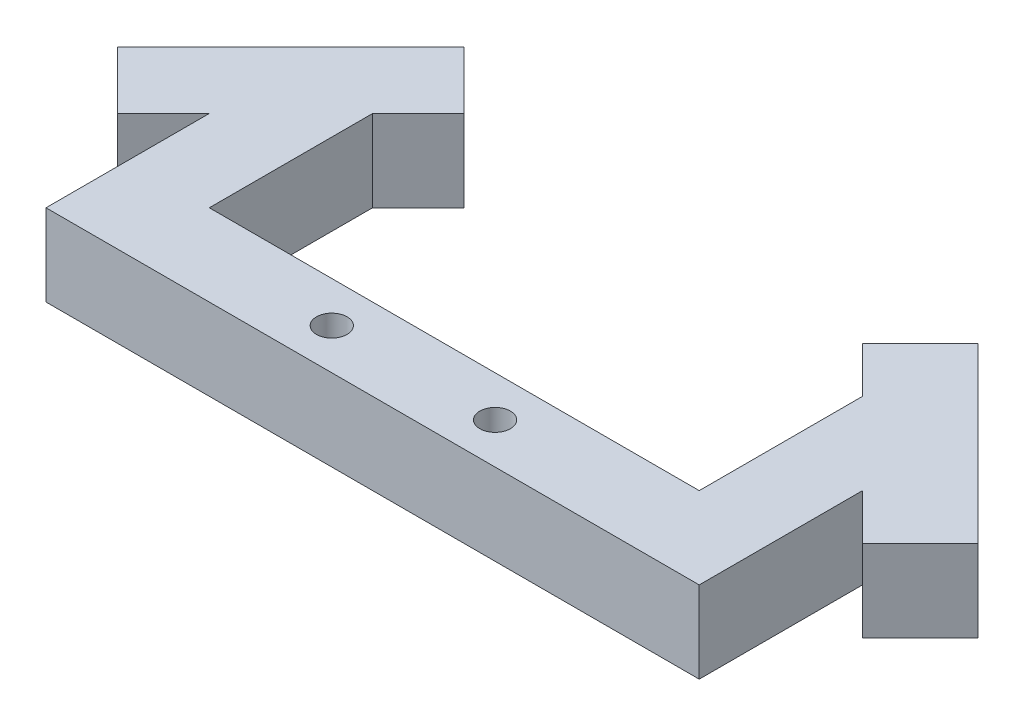
ISO-10303-21;
HEADER;
FILE_DESCRIPTION(('STEP AP214'),'2;1');
FILE_NAME('part.step','',(''),(''),'','','');
FILE_SCHEMA(('AUTOMOTIVE_DESIGN { 1 0 10303 214 1 1 1 1 }'));
ENDSEC;
DATA;
#1=APPLICATION_CONTEXT('core data for automotive mechanical design processes');
#2=APPLICATION_PROTOCOL_DEFINITION('international standard','automotive_design',2000,#1);
#3=PRODUCT_CONTEXT('',#1,'mechanical');
#4=PRODUCT('Part','Part','',(#3));
#5=PRODUCT_RELATED_PRODUCT_CATEGORY('part','',(#4));
#6=PRODUCT_DEFINITION_FORMATION('','',#4);
#7=PRODUCT_DEFINITION_CONTEXT('part definition',#1,'design');
#8=PRODUCT_DEFINITION('design','',#6,#7);
#9=PRODUCT_DEFINITION_SHAPE('','',#8);
#10=(LENGTH_UNIT() NAMED_UNIT(*) SI_UNIT(.MILLI.,.METRE.));
#11=(NAMED_UNIT(*) PLANE_ANGLE_UNIT() SI_UNIT($,.RADIAN.));
#12=(NAMED_UNIT(*) SI_UNIT($,.STERADIAN.) SOLID_ANGLE_UNIT());
#13=UNCERTAINTY_MEASURE_WITH_UNIT(LENGTH_MEASURE(1.E-05),#10,'distance_accuracy_value','');
#14=(GEOMETRIC_REPRESENTATION_CONTEXT(3) GLOBAL_UNCERTAINTY_ASSIGNED_CONTEXT((#13)) GLOBAL_UNIT_ASSIGNED_CONTEXT((#10,
#11,#12)) REPRESENTATION_CONTEXT('',''));
#15=CARTESIAN_POINT('',(0.,0.,0.));
#16=DIRECTION('',(0.,0.,1.));
#17=DIRECTION('',(1.,0.,0.));
#18=AXIS2_PLACEMENT_3D('',#15,#16,#17);
#19=CARTESIAN_POINT('',(0.,25.4,0.));
#20=DIRECTION('',(0.,0.,1.));
#21=DIRECTION('',(1.,0.,0.));
#22=AXIS2_PLACEMENT_3D('',#19,#20,#21);
#23=PLANE('',#22);
#24=DIRECTION('',(-1.,0.,0.));
#25=VECTOR('',#24,1.);
#26=CARTESIAN_POINT('',(0.,0.,0.));
#27=LINE('',#26,#25);
#28=CARTESIAN_POINT('',(101.6,0.,0.));
#29=VERTEX_POINT('',#28);
#30=CARTESIAN_POINT('',(-101.6,0.,0.));
#31=VERTEX_POINT('',#30);
#32=EDGE_CURVE('E185',#29,#31,#27,.T.);
#33=ORIENTED_EDGE('',*,*,#32,.F.);
#34=DIRECTION('',(0.,-1.,0.));
#35=VECTOR('',#34,1.);
#36=CARTESIAN_POINT('',(101.6,25.4,0.));
#37=LINE('',#36,#35);
#38=CARTESIAN_POINT('',(101.6,25.4,0.));
#39=VERTEX_POINT('',#38);
#40=EDGE_CURVE('E11',#39,#29,#37,.T.);
#41=ORIENTED_EDGE('',*,*,#40,.F.);
#42=DIRECTION('',(-1.,0.,0.));
#43=VECTOR('',#42,1.);
#44=CARTESIAN_POINT('',(0.,25.4,0.));
#45=LINE('',#44,#43);
#46=CARTESIAN_POINT('',(-101.6,25.4,0.));
#47=VERTEX_POINT('',#46);
#48=EDGE_CURVE('E225',#39,#47,#45,.T.);
#49=ORIENTED_EDGE('',*,*,#48,.T.);
#50=DIRECTION('',(0.,-1.,0.));
#51=VECTOR('',#50,1.);
#52=CARTESIAN_POINT('',(-101.6,25.4,0.));
#53=LINE('',#52,#51);
#54=EDGE_CURVE('E57',#47,#31,#53,.T.);
#55=ORIENTED_EDGE('',*,*,#54,.T.);
#56=EDGE_LOOP('',(#33,#41,#49,#55));
#57=FACE_BOUND('',#56,.T.);
#58=ADVANCED_FACE('F41',(#57),#23,.T.);
#59=CARTESIAN_POINT('',(101.6,25.4,0.));
#60=DIRECTION('',(-1.,0.,0.));
#61=DIRECTION('',(0.,0.,1.));
#62=AXIS2_PLACEMENT_3D('',#59,#60,#61);
#63=PLANE('',#62);
#64=DIRECTION('',(0.,0.,-1.));
#65=VECTOR('',#64,1.);
#66=CARTESIAN_POINT('',(101.6,0.,0.));
#67=LINE('',#66,#65);
#68=CARTESIAN_POINT('',(101.6,0.,-50.8000000000001));
#69=VERTEX_POINT('',#68);
#70=EDGE_CURVE('E187',#29,#69,#67,.T.);
#71=ORIENTED_EDGE('',*,*,#70,.T.);
#72=DIRECTION('',(0.,-1.,0.));
#73=VECTOR('',#72,1.);
#74=CARTESIAN_POINT('',(101.6,25.4,-50.8000000000001));
#75=LINE('',#74,#73);
#76=CARTESIAN_POINT('',(101.6,25.4,-50.8000000000001));
#77=VERTEX_POINT('',#76);
#78=EDGE_CURVE('E49',#77,#69,#75,.T.);
#79=ORIENTED_EDGE('',*,*,#78,.F.);
#80=DIRECTION('',(0.,0.,-1.));
#81=VECTOR('',#80,1.);
#82=CARTESIAN_POINT('',(101.6,25.4,0.));
#83=LINE('',#82,#81);
#84=EDGE_CURVE('E595',#39,#77,#83,.T.);
#85=ORIENTED_EDGE('',*,*,#84,.F.);
#86=ORIENTED_EDGE('',*,*,#40,.T.);
#87=EDGE_LOOP('',(#71,#79,#85,#86));
#88=FACE_BOUND('',#87,.T.);
#89=ADVANCED_FACE('F259',(#88),#63,.F.);
#90=CARTESIAN_POINT('',(76.1999999999998,25.4,-76.2000000000002));
#91=DIRECTION('',(-0.707106781186546,0.,0.707106781186549));
#92=DIRECTION('',(0.707106781186549,0.,0.707106781186546));
#93=AXIS2_PLACEMENT_3D('',#90,#91,#92);
#94=PLANE('',#93);
#95=DIRECTION('',(-0.707106781186549,0.,-0.707106781186546));
#96=VECTOR('',#95,1.);
#97=CARTESIAN_POINT('',(76.1999999999998,0.,-76.2000000000002));
#98=LINE('',#97,#96);
#99=CARTESIAN_POINT('',(115.840768363208,0.,-36.5592316367926));
#100=VERTEX_POINT('',#99);
#101=EDGE_CURVE('E191',#100,#69,#98,.T.);
#102=ORIENTED_EDGE('',*,*,#101,.F.);
#103=DIRECTION('',(0.,-1.,0.));
#104=VECTOR('',#103,1.);
#105=CARTESIAN_POINT('',(115.840768363208,25.4,-36.5592316367926));
#106=LINE('',#105,#104);
#107=CARTESIAN_POINT('',(115.840768363208,25.4,-36.5592316367926));
#108=VERTEX_POINT('',#107);
#109=EDGE_CURVE('E249',#108,#100,#106,.T.);
#110=ORIENTED_EDGE('',*,*,#109,.F.);
#111=DIRECTION('',(-0.707106781186549,0.,-0.707106781186546));
#112=VECTOR('',#111,1.);
#113=CARTESIAN_POINT('',(76.1999999999998,25.4,-76.2000000000002));
#114=LINE('',#113,#112);
#115=EDGE_CURVE('E256',#108,#77,#114,.T.);
#116=ORIENTED_EDGE('',*,*,#115,.T.);
#117=ORIENTED_EDGE('',*,*,#78,.T.);
#118=EDGE_LOOP('',(#102,#110,#116,#117));
#119=FACE_BOUND('',#118,.T.);
#120=ADVANCED_FACE('F254',(#119),#94,.T.);
#121=CARTESIAN_POINT('',(39.6407683632075,25.4,39.6407683632075));
#122=DIRECTION('',(-0.707106781186548,0.,-0.707106781186547));
#123=DIRECTION('',(-0.707106781186547,0.,0.707106781186548));
#124=AXIS2_PLACEMENT_3D('',#121,#122,#123);
#125=PLANE('',#124);
#126=DIRECTION('',(0.707106781186547,0.,-0.707106781186548));
#127=VECTOR('',#126,1.);
#128=CARTESIAN_POINT('',(39.6407683632075,0.,39.6407683632075));
#129=LINE('',#128,#127);
#130=CARTESIAN_POINT('',(133.801280605346,0.,-54.5197438789309));
#131=VERTEX_POINT('',#130);
#132=EDGE_CURVE('E194',#100,#131,#129,.T.);
#133=ORIENTED_EDGE('',*,*,#132,.T.);
#134=DIRECTION('',(0.,-1.,0.));
#135=VECTOR('',#134,1.);
#136=CARTESIAN_POINT('',(133.801280605346,25.4,-54.5197438789309));
#137=LINE('',#136,#135);
#138=CARTESIAN_POINT('',(133.801280605346,25.4,-54.5197438789309));
#139=VERTEX_POINT('',#138);
#140=EDGE_CURVE('E246',#139,#131,#137,.T.);
#141=ORIENTED_EDGE('',*,*,#140,.F.);
#142=DIRECTION('',(0.707106781186547,0.,-0.707106781186548));
#143=VECTOR('',#142,1.);
#144=CARTESIAN_POINT('',(39.6407683632075,25.4,39.6407683632075));
#145=LINE('',#144,#143);
#146=EDGE_CURVE('E276',#108,#139,#145,.T.);
#147=ORIENTED_EDGE('',*,*,#146,.F.);
#148=ORIENTED_EDGE('',*,*,#109,.T.);
#149=EDGE_LOOP('',(#133,#141,#147,#148));
#150=FACE_BOUND('',#149,.T.);
#151=ADVANCED_FACE('F266',(#150),#125,.F.);
#152=CARTESIAN_POINT('',(94.1605122421383,25.4,-94.1605122421384));
#153=DIRECTION('',(-0.707106781186547,0.,0.707106781186548));
#154=DIRECTION('',(0.707106781186548,0.,0.707106781186547));
#155=AXIS2_PLACEMENT_3D('',#152,#153,#154);
#156=PLANE('',#155);
#157=DIRECTION('',(-0.707106781186548,0.,-0.707106781186547));
#158=VECTOR('',#157,1.);
#159=CARTESIAN_POINT('',(94.1605122421383,0.,-94.1605122421384));
#160=LINE('',#159,#158);
#161=CARTESIAN_POINT('',(79.9197438789308,0.,-108.401280605346));
#162=VERTEX_POINT('',#161);
#163=EDGE_CURVE('E197',#131,#162,#160,.T.);
#164=ORIENTED_EDGE('',*,*,#163,.T.);
#165=DIRECTION('',(0.,-1.,0.));
#166=VECTOR('',#165,1.);
#167=CARTESIAN_POINT('',(79.9197438789308,25.4,-108.401280605346));
#168=LINE('',#167,#166);
#169=CARTESIAN_POINT('',(79.9197438789308,25.4,-108.401280605346));
#170=VERTEX_POINT('',#169);
#171=EDGE_CURVE('E244',#170,#162,#168,.T.);
#172=ORIENTED_EDGE('',*,*,#171,.F.);
#173=DIRECTION('',(-0.707106781186548,0.,-0.707106781186547));
#174=VECTOR('',#173,1.);
#175=CARTESIAN_POINT('',(94.1605122421383,25.4,-94.1605122421384));
#176=LINE('',#175,#174);
#177=EDGE_CURVE('E272',#139,#170,#176,.T.);
#178=ORIENTED_EDGE('',*,*,#177,.F.);
#179=ORIENTED_EDGE('',*,*,#140,.T.);
#180=EDGE_LOOP('',(#164,#172,#178,#179));
#181=FACE_BOUND('',#180,.T.);
#182=ADVANCED_FACE('F270',(#181),#156,.F.);
#183=CARTESIAN_POINT('',(-14.2407683632075,25.4,-14.2407683632075));
#184=DIRECTION('',(-0.707106781186548,0.,-0.707106781186548));
#185=DIRECTION('',(-0.707106781186548,0.,0.707106781186548));
#186=AXIS2_PLACEMENT_3D('',#183,#184,#185);
#187=PLANE('',#186);
#188=DIRECTION('',(0.707106781186548,0.,-0.707106781186548));
#189=VECTOR('',#188,1.);
#190=CARTESIAN_POINT('',(-14.2407683632075,0.,-14.2407683632075));
#191=LINE('',#190,#189);
#192=CARTESIAN_POINT('',(61.9592316367926,0.,-90.4407683632075));
#193=VERTEX_POINT('',#192);
#194=EDGE_CURVE('E200',#193,#162,#191,.T.);
#195=ORIENTED_EDGE('',*,*,#194,.F.);
#196=DIRECTION('',(0.,-1.,0.));
#197=VECTOR('',#196,1.);
#198=CARTESIAN_POINT('',(61.9592316367926,25.4,-90.4407683632075));
#199=LINE('',#198,#197);
#200=CARTESIAN_POINT('',(61.9592316367926,25.4,-90.4407683632075));
#201=VERTEX_POINT('',#200);
#202=EDGE_CURVE('E242',#201,#193,#199,.T.);
#203=ORIENTED_EDGE('',*,*,#202,.F.);
#204=DIRECTION('',(0.707106781186548,0.,-0.707106781186548));
#205=VECTOR('',#204,1.);
#206=CARTESIAN_POINT('',(-14.2407683632075,25.4,-14.2407683632075));
#207=LINE('',#206,#205);
#208=EDGE_CURVE('E275',#201,#170,#207,.T.);
#209=ORIENTED_EDGE('',*,*,#208,.T.);
#210=ORIENTED_EDGE('',*,*,#171,.T.);
#211=EDGE_LOOP('',(#195,#203,#209,#210));
#212=FACE_BOUND('',#211,.T.);
#213=ADVANCED_FACE('F328',(#212),#187,.T.);
#214=CARTESIAN_POINT('',(76.2,0.,-76.2));
#215=VERTEX_POINT('',#214);
#216=EDGE_CURVE('E195',#215,#193,#98,.T.);
#217=ORIENTED_EDGE('',*,*,#216,.F.);
#218=DIRECTION('',(0.,-1.,0.));
#219=VECTOR('',#218,1.);
#220=CARTESIAN_POINT('',(76.2,25.4,-76.2));
#221=LINE('',#220,#219);
#222=CARTESIAN_POINT('',(76.2,25.4,-76.2));
#223=VERTEX_POINT('',#222);
#224=EDGE_CURVE('E240',#223,#215,#221,.T.);
#225=ORIENTED_EDGE('',*,*,#224,.F.);
#226=EDGE_CURVE('E278',#223,#201,#114,.T.);
#227=ORIENTED_EDGE('',*,*,#226,.T.);
#228=ORIENTED_EDGE('',*,*,#202,.T.);
#229=EDGE_LOOP('',(#217,#225,#227,#228));
#230=FACE_BOUND('',#229,.T.);
#231=ADVANCED_FACE('F322',(#230),#94,.T.);
#232=CARTESIAN_POINT('',(76.2,25.4,0.));
#233=DIRECTION('',(1.,0.,0.));
#234=DIRECTION('',(0.,0.,-1.));
#235=AXIS2_PLACEMENT_3D('',#232,#233,#234);
#236=PLANE('',#235);
#237=DIRECTION('',(0.,0.,1.));
#238=VECTOR('',#237,1.);
#239=CARTESIAN_POINT('',(76.2,0.,0.));
#240=LINE('',#239,#238);
#241=CARTESIAN_POINT('',(76.2,0.,-25.4));
#242=VERTEX_POINT('',#241);
#243=EDGE_CURVE('E203',#215,#242,#240,.T.);
#244=ORIENTED_EDGE('',*,*,#243,.T.);
#245=DIRECTION('',(0.,-1.,0.));
#246=VECTOR('',#245,1.);
#247=CARTESIAN_POINT('',(76.2,25.4,-25.4));
#248=LINE('',#247,#246);
#249=CARTESIAN_POINT('',(76.2,25.4,-25.4));
#250=VERTEX_POINT('',#249);
#251=EDGE_CURVE('E238',#250,#242,#248,.T.);
#252=ORIENTED_EDGE('',*,*,#251,.F.);
#253=DIRECTION('',(0.,0.,1.));
#254=VECTOR('',#253,1.);
#255=CARTESIAN_POINT('',(76.2,25.4,0.));
#256=LINE('',#255,#254);
#257=EDGE_CURVE('E283',#223,#250,#256,.T.);
#258=ORIENTED_EDGE('',*,*,#257,.F.);
#259=ORIENTED_EDGE('',*,*,#224,.T.);
#260=EDGE_LOOP('',(#244,#252,#258,#259));
#261=FACE_BOUND('',#260,.T.);
#262=ADVANCED_FACE('F333',(#261),#236,.F.);
#263=CARTESIAN_POINT('',(0.,25.4,-25.4));
#264=DIRECTION('',(0.,0.,-1.));
#265=DIRECTION('',(-1.,0.,0.));
#266=AXIS2_PLACEMENT_3D('',#263,#264,#265);
#267=PLANE('',#266);
#268=DIRECTION('',(1.,0.,0.));
#269=VECTOR('',#268,1.);
#270=CARTESIAN_POINT('',(0.,0.,-25.4));
#271=LINE('',#270,#269);
#272=CARTESIAN_POINT('',(-76.2,0.,-25.4));
#273=VERTEX_POINT('',#272);
#274=EDGE_CURVE('E206',#273,#242,#271,.T.);
#275=ORIENTED_EDGE('',*,*,#274,.F.);
#276=DIRECTION('',(0.,-1.,0.));
#277=VECTOR('',#276,1.);
#278=CARTESIAN_POINT('',(-76.2,25.4,-25.4));
#279=LINE('',#278,#277);
#280=CARTESIAN_POINT('',(-76.2,25.4,-25.4));
#281=VERTEX_POINT('',#280);
#282=EDGE_CURVE('E236',#281,#273,#279,.T.);
#283=ORIENTED_EDGE('',*,*,#282,.F.);
#284=DIRECTION('',(1.,0.,0.));
#285=VECTOR('',#284,1.);
#286=CARTESIAN_POINT('',(0.,25.4,-25.4));
#287=LINE('',#286,#285);
#288=EDGE_CURVE('E285',#281,#250,#287,.T.);
#289=ORIENTED_EDGE('',*,*,#288,.T.);
#290=ORIENTED_EDGE('',*,*,#251,.T.);
#291=EDGE_LOOP('',(#275,#283,#289,#290));
#292=FACE_BOUND('',#291,.T.);
#293=ADVANCED_FACE('F337',(#292),#267,.T.);
#294=CARTESIAN_POINT('',(-76.2,25.4,0.));
#295=DIRECTION('',(1.,0.,0.));
#296=DIRECTION('',(0.,0.,-1.));
#297=AXIS2_PLACEMENT_3D('',#294,#295,#296);
#298=PLANE('',#297);
#299=DIRECTION('',(0.,0.,1.));
#300=VECTOR('',#299,1.);
#301=CARTESIAN_POINT('',(-76.2,0.,0.));
#302=LINE('',#301,#300);
#303=CARTESIAN_POINT('',(-76.2,0.,-76.2));
#304=VERTEX_POINT('',#303);
#305=EDGE_CURVE('E209',#304,#273,#302,.T.);
#306=ORIENTED_EDGE('',*,*,#305,.F.);
#307=DIRECTION('',(0.,-1.,0.));
#308=VECTOR('',#307,1.);
#309=CARTESIAN_POINT('',(-76.2,25.4,-76.2));
#310=LINE('',#309,#308);
#311=CARTESIAN_POINT('',(-76.2,25.4,-76.2));
#312=VERTEX_POINT('',#311);
#313=EDGE_CURVE('E234',#312,#304,#310,.T.);
#314=ORIENTED_EDGE('',*,*,#313,.F.);
#315=DIRECTION('',(0.,0.,1.));
#316=VECTOR('',#315,1.);
#317=CARTESIAN_POINT('',(-76.2,25.4,0.));
#318=LINE('',#317,#316);
#319=EDGE_CURVE('E288',#312,#281,#318,.T.);
#320=ORIENTED_EDGE('',*,*,#319,.T.);
#321=ORIENTED_EDGE('',*,*,#282,.T.);
#322=EDGE_LOOP('',(#306,#314,#320,#321));
#323=FACE_BOUND('',#322,.T.);
#324=ADVANCED_FACE('F341',(#323),#298,.T.);
#325=CARTESIAN_POINT('',(-76.2000000000002,25.4,-76.1999999999998));
#326=DIRECTION('',(-0.707106781186549,0.,-0.707106781186545));
#327=DIRECTION('',(-0.707106781186545,0.,0.70710678118655));
#328=AXIS2_PLACEMENT_3D('',#325,#326,#327);
#329=PLANE('',#328);
#330=DIRECTION('',(0.707106781186546,0.,-0.70710678118655));
#331=VECTOR('',#330,1.);
#332=CARTESIAN_POINT('',(-76.2000000000002,0.,-76.1999999999998));
#333=LINE('',#332,#331);
#334=CARTESIAN_POINT('',(-61.9592316367926,0.,-90.4407683632075));
#335=VERTEX_POINT('',#334);
#336=EDGE_CURVE('E212',#304,#335,#333,.T.);
#337=ORIENTED_EDGE('',*,*,#336,.T.);
#338=DIRECTION('',(0.,-1.,0.));
#339=VECTOR('',#338,1.);
#340=CARTESIAN_POINT('',(-61.9592316367926,25.4,-90.4407683632075));
#341=LINE('',#340,#339);
#342=CARTESIAN_POINT('',(-61.9592316367926,25.4,-90.4407683632075));
#343=VERTEX_POINT('',#342);
#344=EDGE_CURVE('E231',#343,#335,#341,.T.);
#345=ORIENTED_EDGE('',*,*,#344,.F.);
#346=DIRECTION('',(0.707106781186546,0.,-0.70710678118655));
#347=VECTOR('',#346,1.);
#348=CARTESIAN_POINT('',(-76.2000000000002,25.4,-76.1999999999998));
#349=LINE('',#348,#347);
#350=EDGE_CURVE('E173',#312,#343,#349,.T.);
#351=ORIENTED_EDGE('',*,*,#350,.F.);
#352=ORIENTED_EDGE('',*,*,#313,.T.);
#353=EDGE_LOOP('',(#337,#345,#351,#352));
#354=FACE_BOUND('',#353,.T.);
#355=ADVANCED_FACE('F312',(#354),#329,.F.);
#356=CARTESIAN_POINT('',(14.2407683632075,25.4,-14.2407683632075));
#357=DIRECTION('',(-0.707106781186547,0.,0.707106781186548));
#358=DIRECTION('',(0.707106781186548,0.,0.707106781186547));
#359=AXIS2_PLACEMENT_3D('',#356,#357,#358);
#360=PLANE('',#359);
#361=DIRECTION('',(-0.707106781186548,0.,-0.707106781186547));
#362=VECTOR('',#361,1.);
#363=CARTESIAN_POINT('',(14.2407683632075,0.,-14.2407683632075));
#364=LINE('',#363,#362);
#365=CARTESIAN_POINT('',(-79.9197438789309,0.,-108.401280605346));
#366=VERTEX_POINT('',#365);
#367=EDGE_CURVE('E214',#335,#366,#364,.T.);
#368=ORIENTED_EDGE('',*,*,#367,.T.);
#369=DIRECTION('',(0.,-1.,0.));
#370=VECTOR('',#369,1.);
#371=CARTESIAN_POINT('',(-79.9197438789309,25.4,-108.401280605346));
#372=LINE('',#371,#370);
#373=CARTESIAN_POINT('',(-79.9197438789309,25.4,-108.401280605346));
#374=VERTEX_POINT('',#373);
#375=EDGE_CURVE('E229',#374,#366,#372,.T.);
#376=ORIENTED_EDGE('',*,*,#375,.F.);
#377=DIRECTION('',(-0.707106781186548,0.,-0.707106781186547));
#378=VECTOR('',#377,1.);
#379=CARTESIAN_POINT('',(14.2407683632075,25.4,-14.2407683632075));
#380=LINE('',#379,#378);
#381=EDGE_CURVE('E180',#343,#374,#380,.T.);
#382=ORIENTED_EDGE('',*,*,#381,.F.);
#383=ORIENTED_EDGE('',*,*,#344,.T.);
#384=EDGE_LOOP('',(#368,#376,#382,#383));
#385=FACE_BOUND('',#384,.T.);
#386=ADVANCED_FACE('F296',(#385),#360,.F.);
#387=CARTESIAN_POINT('',(-94.1605122421383,25.4,-94.1605122421383));
#388=DIRECTION('',(-0.707106781186548,0.,-0.707106781186548));
#389=DIRECTION('',(-0.707106781186548,0.,0.707106781186548));
#390=AXIS2_PLACEMENT_3D('',#387,#388,#389);
#391=PLANE('',#390);
#392=DIRECTION('',(0.707106781186548,0.,-0.707106781186548));
#393=VECTOR('',#392,1.);
#394=CARTESIAN_POINT('',(-94.1605122421383,0.,-94.1605122421383));
#395=LINE('',#394,#393);
#396=CARTESIAN_POINT('',(-133.801280605346,0.,-54.5197438789309));
#397=VERTEX_POINT('',#396);
#398=EDGE_CURVE('E218',#397,#366,#395,.T.);
#399=ORIENTED_EDGE('',*,*,#398,.F.);
#400=DIRECTION('',(0.,-1.,0.));
#401=VECTOR('',#400,1.);
#402=CARTESIAN_POINT('',(-133.801280605346,25.4,-54.5197438789309));
#403=LINE('',#402,#401);
#404=CARTESIAN_POINT('',(-133.801280605346,25.4,-54.5197438789309));
#405=VERTEX_POINT('',#404);
#406=EDGE_CURVE('E165',#405,#397,#403,.T.);
#407=ORIENTED_EDGE('',*,*,#406,.F.);
#408=DIRECTION('',(0.707106781186548,0.,-0.707106781186548));
#409=VECTOR('',#408,1.);
#410=CARTESIAN_POINT('',(-94.1605122421383,25.4,-94.1605122421383));
#411=LINE('',#410,#409);
#412=EDGE_CURVE('E178',#405,#374,#411,.T.);
#413=ORIENTED_EDGE('',*,*,#412,.T.);
#414=ORIENTED_EDGE('',*,*,#375,.T.);
#415=EDGE_LOOP('',(#399,#407,#413,#414));
#416=FACE_BOUND('',#415,.T.);
#417=ADVANCED_FACE('F300',(#416),#391,.T.);
#418=CARTESIAN_POINT('',(-39.6407683632075,25.4,39.6407683632075));
#419=DIRECTION('',(-0.707106781186548,0.,0.707106781186547));
#420=DIRECTION('',(0.707106781186547,0.,0.707106781186548));
#421=AXIS2_PLACEMENT_3D('',#418,#419,#420);
#422=PLANE('',#421);
#423=DIRECTION('',(-0.707106781186547,0.,-0.707106781186548));
#424=VECTOR('',#423,1.);
#425=CARTESIAN_POINT('',(-39.6407683632075,0.,39.6407683632075));
#426=LINE('',#425,#424);
#427=CARTESIAN_POINT('',(-115.840768363207,0.,-36.5592316367926));
#428=VERTEX_POINT('',#427);
#429=EDGE_CURVE('E162',#428,#397,#426,.T.);
#430=ORIENTED_EDGE('',*,*,#429,.F.);
#431=DIRECTION('',(0.,-1.,0.));
#432=VECTOR('',#431,1.);
#433=CARTESIAN_POINT('',(-115.840768363207,25.4,-36.5592316367926));
#434=LINE('',#433,#432);
#435=CARTESIAN_POINT('',(-115.840768363207,25.4,-36.5592316367926));
#436=VERTEX_POINT('',#435);
#437=EDGE_CURVE('E156',#436,#428,#434,.T.);
#438=ORIENTED_EDGE('',*,*,#437,.F.);
#439=DIRECTION('',(-0.707106781186547,0.,-0.707106781186548));
#440=VECTOR('',#439,1.);
#441=CARTESIAN_POINT('',(-39.6407683632075,25.4,39.6407683632075));
#442=LINE('',#441,#440);
#443=EDGE_CURVE('E160',#436,#405,#442,.T.);
#444=ORIENTED_EDGE('',*,*,#443,.T.);
#445=ORIENTED_EDGE('',*,*,#406,.T.);
#446=EDGE_LOOP('',(#430,#438,#444,#445));
#447=FACE_BOUND('',#446,.T.);
#448=ADVANCED_FACE('F158',(#447),#422,.T.);
#449=CARTESIAN_POINT('',(-101.6,0.,-50.8));
#450=VERTEX_POINT('',#449);
#451=EDGE_CURVE('E215',#428,#450,#333,.T.);
#452=ORIENTED_EDGE('',*,*,#451,.T.);
#453=DIRECTION('',(0.,-1.,0.));
#454=VECTOR('',#453,1.);
#455=CARTESIAN_POINT('',(-101.6,25.4,-50.8));
#456=LINE('',#455,#454);
#457=CARTESIAN_POINT('',(-101.6,25.4,-50.8));
#458=VERTEX_POINT('',#457);
#459=EDGE_CURVE('E107',#458,#450,#456,.T.);
#460=ORIENTED_EDGE('',*,*,#459,.F.);
#461=EDGE_CURVE('E167',#436,#458,#349,.T.);
#462=ORIENTED_EDGE('',*,*,#461,.F.);
#463=ORIENTED_EDGE('',*,*,#437,.T.);
#464=EDGE_LOOP('',(#452,#460,#462,#463));
#465=FACE_BOUND('',#464,.T.);
#466=ADVANCED_FACE('F168',(#465),#329,.F.);
#467=CARTESIAN_POINT('',(-101.6,25.4,0.));
#468=DIRECTION('',(-1.,0.,0.));
#469=DIRECTION('',(0.,0.,1.));
#470=AXIS2_PLACEMENT_3D('',#467,#468,#469);
#471=PLANE('',#470);
#472=DIRECTION('',(0.,0.,-1.));
#473=VECTOR('',#472,1.);
#474=CARTESIAN_POINT('',(-101.6,0.,0.));
#475=LINE('',#474,#473);
#476=EDGE_CURVE('E222',#31,#450,#475,.T.);
#477=ORIENTED_EDGE('',*,*,#476,.F.);
#478=ORIENTED_EDGE('',*,*,#54,.F.);
#479=DIRECTION('',(0.,0.,-1.));
#480=VECTOR('',#479,1.);
#481=CARTESIAN_POINT('',(-101.6,25.4,0.));
#482=LINE('',#481,#480);
#483=EDGE_CURVE('E171',#47,#458,#482,.T.);
#484=ORIENTED_EDGE('',*,*,#483,.T.);
#485=ORIENTED_EDGE('',*,*,#459,.T.);
#486=EDGE_LOOP('',(#477,#478,#484,#485));
#487=FACE_BOUND('',#486,.T.);
#488=ADVANCED_FACE('F301',(#487),#471,.T.);
#489=CARTESIAN_POINT('',(0.,25.4,0.));
#490=DIRECTION('',(0.,1.,0.));
#491=DIRECTION('',(0.,0.,1.));
#492=AXIS2_PLACEMENT_3D('',#489,#490,#491);
#493=PLANE('',#492);
#494=CARTESIAN_POINT('',(25.4,25.4,-12.7));
#495=DIRECTION('',(0.,1.,0.));
#496=DIRECTION('',(0.,0.,1.));
#497=AXIS2_PLACEMENT_3D('',#494,#495,#496);
#498=CIRCLE('',#497,4.7625);
#499=CARTESIAN_POINT('',(25.4,25.4,-7.9375));
#500=VERTEX_POINT('',#499);
#501=EDGE_CURVE('E188',#500,#500,#498,.T.);
#502=ORIENTED_EDGE('',*,*,#501,.F.);
#503=EDGE_LOOP('',(#502));
#504=FACE_BOUND('',#503,.T.);
#505=CARTESIAN_POINT('',(-25.4,25.4,-12.7));
#506=DIRECTION('',(0.,1.,0.));
#507=DIRECTION('',(0.,0.,1.));
#508=AXIS2_PLACEMENT_3D('',#505,#506,#507);
#509=CIRCLE('',#508,4.7625);
#510=CARTESIAN_POINT('',(-25.4,25.4,-7.9375));
#511=VERTEX_POINT('',#510);
#512=EDGE_CURVE('E600',#511,#511,#509,.T.);
#513=ORIENTED_EDGE('',*,*,#512,.F.);
#514=EDGE_LOOP('',(#513));
#515=FACE_BOUND('',#514,.T.);
#516=ORIENTED_EDGE('',*,*,#48,.F.);
#517=ORIENTED_EDGE('',*,*,#84,.T.);
#518=ORIENTED_EDGE('',*,*,#115,.F.);
#519=ORIENTED_EDGE('',*,*,#146,.T.);
#520=ORIENTED_EDGE('',*,*,#177,.T.);
#521=ORIENTED_EDGE('',*,*,#208,.F.);
#522=ORIENTED_EDGE('',*,*,#226,.F.);
#523=ORIENTED_EDGE('',*,*,#257,.T.);
#524=ORIENTED_EDGE('',*,*,#288,.F.);
#525=ORIENTED_EDGE('',*,*,#319,.F.);
#526=ORIENTED_EDGE('',*,*,#350,.T.);
#527=ORIENTED_EDGE('',*,*,#381,.T.);
#528=ORIENTED_EDGE('',*,*,#412,.F.);
#529=ORIENTED_EDGE('',*,*,#443,.F.);
#530=ORIENTED_EDGE('',*,*,#461,.T.);
#531=ORIENTED_EDGE('',*,*,#483,.F.);
#532=EDGE_LOOP('',(#516,#517,#518,#519,#520,#521,#522,#523,#524,#525,#526,#527,#528,#529,#530,#531));
#533=FACE_BOUND('',#532,.T.);
#534=ADVANCED_FACE('F176',(#504,#515,#533),#493,.T.);
#535=CARTESIAN_POINT('',(0.,0.,0.));
#536=DIRECTION('',(0.,1.,0.));
#537=DIRECTION('',(0.,0.,1.));
#538=AXIS2_PLACEMENT_3D('',#535,#536,#537);
#539=PLANE('',#538);
#540=CARTESIAN_POINT('',(25.4,0.,-12.7));
#541=DIRECTION('',(0.,1.,0.));
#542=DIRECTION('',(0.,0.,1.));
#543=AXIS2_PLACEMENT_3D('',#540,#541,#542);
#544=CIRCLE('',#543,4.7625);
#545=CARTESIAN_POINT('',(25.4,0.,-7.9375));
#546=VERTEX_POINT('',#545);
#547=EDGE_CURVE('E603',#546,#546,#544,.T.);
#548=ORIENTED_EDGE('',*,*,#547,.T.);
#549=EDGE_LOOP('',(#548));
#550=FACE_BOUND('',#549,.T.);
#551=CARTESIAN_POINT('',(-25.4,0.,-12.7));
#552=DIRECTION('',(0.,1.,0.));
#553=DIRECTION('',(0.,0.,1.));
#554=AXIS2_PLACEMENT_3D('',#551,#552,#553);
#555=CIRCLE('',#554,4.7625);
#556=CARTESIAN_POINT('',(-25.4,0.,-7.9375));
#557=VERTEX_POINT('',#556);
#558=EDGE_CURVE('E604',#557,#557,#555,.T.);
#559=ORIENTED_EDGE('',*,*,#558,.T.);
#560=EDGE_LOOP('',(#559));
#561=FACE_BOUND('',#560,.T.);
#562=ORIENTED_EDGE('',*,*,#32,.T.);
#563=ORIENTED_EDGE('',*,*,#476,.T.);
#564=ORIENTED_EDGE('',*,*,#451,.F.);
#565=ORIENTED_EDGE('',*,*,#429,.T.);
#566=ORIENTED_EDGE('',*,*,#398,.T.);
#567=ORIENTED_EDGE('',*,*,#367,.F.);
#568=ORIENTED_EDGE('',*,*,#336,.F.);
#569=ORIENTED_EDGE('',*,*,#305,.T.);
#570=ORIENTED_EDGE('',*,*,#274,.T.);
#571=ORIENTED_EDGE('',*,*,#243,.F.);
#572=ORIENTED_EDGE('',*,*,#216,.T.);
#573=ORIENTED_EDGE('',*,*,#194,.T.);
#574=ORIENTED_EDGE('',*,*,#163,.F.);
#575=ORIENTED_EDGE('',*,*,#132,.F.);
#576=ORIENTED_EDGE('',*,*,#101,.T.);
#577=ORIENTED_EDGE('',*,*,#70,.F.);
#578=EDGE_LOOP('',(#562,#563,#564,#565,#566,#567,#568,#569,#570,#571,#572,#573,#574,#575,#576,#577));
#579=FACE_BOUND('',#578,.T.);
#580=ADVANCED_FACE('F262',(#550,#561,#579),#539,.F.);
#581=CARTESIAN_POINT('',(-25.4,0.,-12.7));
#582=DIRECTION('',(0.,1.,0.));
#583=DIRECTION('',(0.,0.,1.));
#584=AXIS2_PLACEMENT_3D('',#581,#582,#583);
#585=CYLINDRICAL_SURFACE('',#584,4.7625);
#586=ORIENTED_EDGE('',*,*,#512,.T.);
#587=EDGE_LOOP('',(#586));
#588=FACE_BOUND('',#587,.T.);
#589=ORIENTED_EDGE('',*,*,#558,.F.);
#590=EDGE_LOOP('',(#589));
#591=FACE_BOUND('',#590,.T.);
#592=ADVANCED_FACE('F381',(#588,#591),#585,.F.);
#593=CARTESIAN_POINT('',(25.4,0.,-12.7));
#594=DIRECTION('',(0.,1.,0.));
#595=DIRECTION('',(0.,0.,1.));
#596=AXIS2_PLACEMENT_3D('',#593,#594,#595);
#597=CYLINDRICAL_SURFACE('',#596,4.7625);
#598=ORIENTED_EDGE('',*,*,#501,.T.);
#599=EDGE_LOOP('',(#598));
#600=FACE_BOUND('',#599,.T.);
#601=ORIENTED_EDGE('',*,*,#547,.F.);
#602=EDGE_LOOP('',(#601));
#603=FACE_BOUND('',#602,.T.);
#604=ADVANCED_FACE('F392',(#600,#603),#597,.F.);
#605=CLOSED_SHELL('',(#58,#89,#120,#151,#182,#213,#231,#262,#293,#324,#355,#386,#417,#448,#466,
#488,#534,#580,#592,#604));
#606=MANIFOLD_SOLID_BREP('B2',#605);
#607=ADVANCED_BREP_SHAPE_REPRESENTATION('',(#18,#606),#14);
#608=SHAPE_DEFINITION_REPRESENTATION(#9,#607);
ENDSEC;
END-ISO-10303-21;
